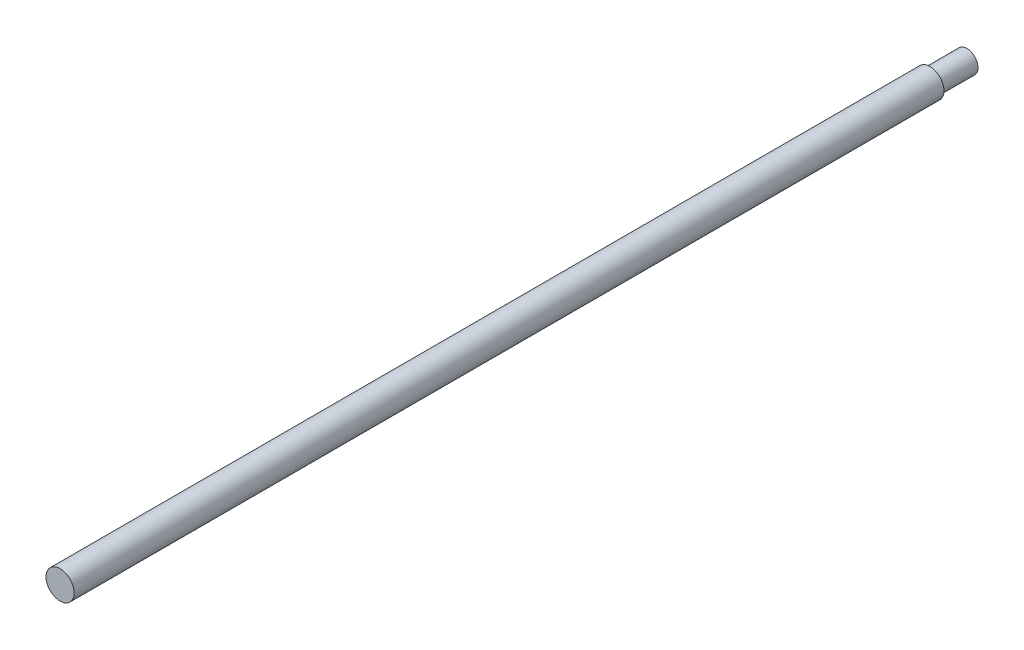
ISO-10303-21;
HEADER;
FILE_DESCRIPTION(('STEP AP214'),'2;1');
FILE_NAME('part.step','',(''),(''),'','','');
FILE_SCHEMA(('AUTOMOTIVE_DESIGN { 1 0 10303 214 1 1 1 1 }'));
ENDSEC;
DATA;
#1=APPLICATION_CONTEXT('core data for automotive mechanical design processes');
#2=APPLICATION_PROTOCOL_DEFINITION('international standard','automotive_design',2000,#1);
#3=PRODUCT_CONTEXT('',#1,'mechanical');
#4=PRODUCT('Part','Part','',(#3));
#5=PRODUCT_RELATED_PRODUCT_CATEGORY('part','',(#4));
#6=PRODUCT_DEFINITION_FORMATION('','',#4);
#7=PRODUCT_DEFINITION_CONTEXT('part definition',#1,'design');
#8=PRODUCT_DEFINITION('design','',#6,#7);
#9=PRODUCT_DEFINITION_SHAPE('','',#8);
#10=(LENGTH_UNIT() NAMED_UNIT(*) SI_UNIT(.MILLI.,.METRE.));
#11=(NAMED_UNIT(*) PLANE_ANGLE_UNIT() SI_UNIT($,.RADIAN.));
#12=(NAMED_UNIT(*) SI_UNIT($,.STERADIAN.) SOLID_ANGLE_UNIT());
#13=UNCERTAINTY_MEASURE_WITH_UNIT(LENGTH_MEASURE(1.E-05),#10,'distance_accuracy_value','');
#14=(GEOMETRIC_REPRESENTATION_CONTEXT(3) GLOBAL_UNCERTAINTY_ASSIGNED_CONTEXT((#13)) GLOBAL_UNIT_ASSIGNED_CONTEXT((#10,
#11,#12)) REPRESENTATION_CONTEXT('',''));
#15=CARTESIAN_POINT('',(0.,0.,0.));
#16=DIRECTION('',(0.,0.,1.));
#17=DIRECTION('',(1.,0.,0.));
#18=AXIS2_PLACEMENT_3D('',#15,#16,#17);
#19=CARTESIAN_POINT('',(0.,0.,245.));
#20=DIRECTION('',(0.,0.,-1.));
#21=DIRECTION('',(-1.,0.,0.));
#22=AXIS2_PLACEMENT_3D('',#19,#20,#21);
#23=CYLINDRICAL_SURFACE('',#22,3.8);
#24=CARTESIAN_POINT('',(0.,0.,245.));
#25=DIRECTION('',(0.,0.,1.));
#26=DIRECTION('',(1.,0.,0.));
#27=AXIS2_PLACEMENT_3D('',#24,#25,#26);
#28=CIRCLE('',#27,3.8);
#29=CARTESIAN_POINT('',(3.8,0.,245.));
#30=VERTEX_POINT('',#29);
#31=EDGE_CURVE('E11',#30,#30,#28,.T.);
#32=ORIENTED_EDGE('',*,*,#31,.F.);
#33=EDGE_LOOP('',(#32));
#34=FACE_BOUND('',#33,.T.);
#35=CARTESIAN_POINT('',(0.,0.,10.));
#36=DIRECTION('',(0.,0.,-1.));
#37=DIRECTION('',(-1.,0.,0.));
#38=AXIS2_PLACEMENT_3D('',#35,#36,#37);
#39=CIRCLE('',#38,3.8);
#40=CARTESIAN_POINT('',(-3.8,0.,10.));
#41=VERTEX_POINT('',#40);
#42=EDGE_CURVE('E41',#41,#41,#39,.T.);
#43=ORIENTED_EDGE('',*,*,#42,.F.);
#44=EDGE_LOOP('',(#43));
#45=FACE_BOUND('',#44,.T.);
#46=ADVANCED_FACE('F38',(#34,#45),#23,.T.);
#47=CARTESIAN_POINT('',(0.,0.,245.));
#48=DIRECTION('',(0.,0.,1.));
#49=DIRECTION('',(1.,0.,0.));
#50=AXIS2_PLACEMENT_3D('',#47,#48,#49);
#51=PLANE('',#50);
#52=ORIENTED_EDGE('',*,*,#31,.T.);
#53=EDGE_LOOP('',(#52));
#54=FACE_BOUND('',#53,.T.);
#55=ADVANCED_FACE('F62',(#54),#51,.T.);
#56=CARTESIAN_POINT('',(0.,0.,10.));
#57=DIRECTION('',(0.,0.,-1.));
#58=DIRECTION('',(-1.,0.,0.));
#59=AXIS2_PLACEMENT_3D('',#56,#57,#58);
#60=PLANE('',#59);
#61=CARTESIAN_POINT('',(0.,0.,10.));
#62=DIRECTION('',(0.,0.,-1.));
#63=DIRECTION('',(-1.,0.,0.));
#64=AXIS2_PLACEMENT_3D('',#61,#62,#63);
#65=CIRCLE('',#64,3.);
#66=CARTESIAN_POINT('',(-3.,0.,10.));
#67=VERTEX_POINT('',#66);
#68=EDGE_CURVE('E48',#67,#67,#65,.T.);
#69=ORIENTED_EDGE('',*,*,#68,.F.);
#70=EDGE_LOOP('',(#69));
#71=FACE_BOUND('',#70,.T.);
#72=ORIENTED_EDGE('',*,*,#42,.T.);
#73=EDGE_LOOP('',(#72));
#74=FACE_BOUND('',#73,.T.);
#75=ADVANCED_FACE('F59',(#71,#74),#60,.T.);
#76=CARTESIAN_POINT('',(0.,0.,10.));
#77=DIRECTION('',(0.,0.,-1.));
#78=DIRECTION('',(-1.,0.,0.));
#79=AXIS2_PLACEMENT_3D('',#76,#77,#78);
#80=CYLINDRICAL_SURFACE('',#79,3.);
#81=ORIENTED_EDGE('',*,*,#68,.T.);
#82=EDGE_LOOP('',(#81));
#83=FACE_BOUND('',#82,.T.);
#84=CARTESIAN_POINT('',(0.,0.,0.));
#85=DIRECTION('',(0.,0.,-1.));
#86=DIRECTION('',(-1.,0.,0.));
#87=AXIS2_PLACEMENT_3D('',#84,#85,#86);
#88=CIRCLE('',#87,3.);
#89=CARTESIAN_POINT('',(-3.,0.,0.));
#90=VERTEX_POINT('',#89);
#91=EDGE_CURVE('E50',#90,#90,#88,.T.);
#92=ORIENTED_EDGE('',*,*,#91,.F.);
#93=EDGE_LOOP('',(#92));
#94=FACE_BOUND('',#93,.T.);
#95=ADVANCED_FACE('F56',(#83,#94),#80,.T.);
#96=CARTESIAN_POINT('',(0.,0.,0.));
#97=DIRECTION('',(0.,0.,1.));
#98=DIRECTION('',(1.,0.,0.));
#99=AXIS2_PLACEMENT_3D('',#96,#97,#98);
#100=PLANE('',#99);
#101=ORIENTED_EDGE('',*,*,#91,.T.);
#102=EDGE_LOOP('',(#101));
#103=FACE_BOUND('',#102,.T.);
#104=ADVANCED_FACE('F75',(#103),#100,.F.);
#105=CLOSED_SHELL('',(#46,#55,#75,#95,#104));
#106=MANIFOLD_SOLID_BREP('B2',#105);
#107=ADVANCED_BREP_SHAPE_REPRESENTATION('',(#18,#106),#14);
#108=SHAPE_DEFINITION_REPRESENTATION(#9,#107);
ENDSEC;
END-ISO-10303-21;
